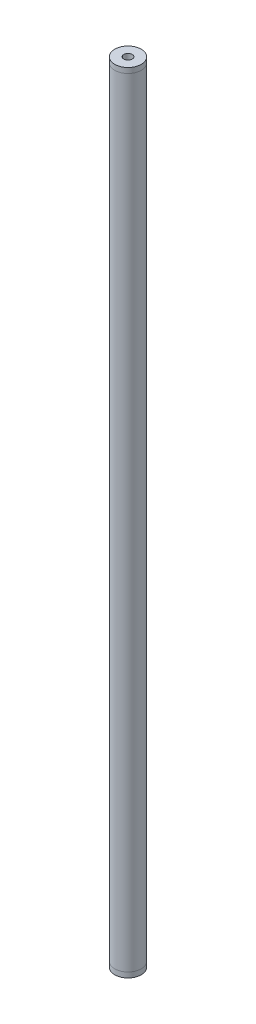
ISO-10303-21;
HEADER;
FILE_DESCRIPTION(('STEP AP214'),'2;1');
FILE_NAME('part.step','',(''),(''),'','','');
FILE_SCHEMA(('AUTOMOTIVE_DESIGN { 1 0 10303 214 1 1 1 1 }'));
ENDSEC;
DATA;
#1=APPLICATION_CONTEXT('core data for automotive mechanical design processes');
#2=APPLICATION_PROTOCOL_DEFINITION('international standard','automotive_design',2000,#1);
#3=PRODUCT_CONTEXT('',#1,'mechanical');
#4=PRODUCT('Part','Part','',(#3));
#5=PRODUCT_RELATED_PRODUCT_CATEGORY('part','',(#4));
#6=PRODUCT_DEFINITION_FORMATION('','',#4);
#7=PRODUCT_DEFINITION_CONTEXT('part definition',#1,'design');
#8=PRODUCT_DEFINITION('design','',#6,#7);
#9=PRODUCT_DEFINITION_SHAPE('','',#8);
#10=(LENGTH_UNIT() NAMED_UNIT(*) SI_UNIT(.MILLI.,.METRE.));
#11=(NAMED_UNIT(*) PLANE_ANGLE_UNIT() SI_UNIT($,.RADIAN.));
#12=(NAMED_UNIT(*) SI_UNIT($,.STERADIAN.) SOLID_ANGLE_UNIT());
#13=UNCERTAINTY_MEASURE_WITH_UNIT(LENGTH_MEASURE(1.E-05),#10,'distance_accuracy_value','');
#14=(GEOMETRIC_REPRESENTATION_CONTEXT(3) GLOBAL_UNCERTAINTY_ASSIGNED_CONTEXT((#13)) GLOBAL_UNIT_ASSIGNED_CONTEXT((#10,
#11,#12)) REPRESENTATION_CONTEXT('',''));
#15=CARTESIAN_POINT('',(0.,0.,0.));
#16=DIRECTION('',(0.,0.,1.));
#17=DIRECTION('',(1.,0.,0.));
#18=AXIS2_PLACEMENT_3D('',#15,#16,#17);
#19=CARTESIAN_POINT('',(25.4,-10.,0.));
#20=DIRECTION('',(0.,-1.,0.));
#21=DIRECTION('',(0.,0.,-1.));
#22=AXIS2_PLACEMENT_3D('',#19,#20,#21);
#23=PLANE('',#22);
#24=CARTESIAN_POINT('',(0.,-10.,0.));
#25=DIRECTION('',(0.,-1.,0.));
#26=DIRECTION('',(0.,0.,-1.));
#27=AXIS2_PLACEMENT_3D('',#24,#25,#26);
#28=CIRCLE('',#27,25.4);
#29=CARTESIAN_POINT('',(0.,-10.,-25.4));
#30=VERTEX_POINT('',#29);
#31=EDGE_CURVE('E64',#30,#30,#28,.T.);
#32=ORIENTED_EDGE('',*,*,#31,.T.);
#33=EDGE_LOOP('',(#32));
#34=FACE_BOUND('',#33,.T.);
#35=CARTESIAN_POINT('',(0.,-10.,0.));
#36=DIRECTION('',(0.,-1.,0.));
#37=DIRECTION('',(0.,0.,-1.));
#38=AXIS2_PLACEMENT_3D('',#35,#36,#37);
#39=CIRCLE('',#38,8.);
#40=CARTESIAN_POINT('',(0.,-10.,-8.));
#41=VERTEX_POINT('',#40);
#42=EDGE_CURVE('E11',#41,#41,#39,.T.);
#43=ORIENTED_EDGE('',*,*,#42,.F.);
#44=EDGE_LOOP('',(#43));
#45=FACE_BOUND('',#44,.T.);
#46=ADVANCED_FACE('F42',(#34,#45),#23,.T.);
#47=CARTESIAN_POINT('',(0.,0.,0.));
#48=DIRECTION('',(0.,-1.,0.));
#49=DIRECTION('',(0.,0.,-1.));
#50=AXIS2_PLACEMENT_3D('',#47,#48,#49);
#51=CYLINDRICAL_SURFACE('',#50,8.);
#52=ORIENTED_EDGE('',*,*,#42,.T.);
#53=EDGE_LOOP('',(#52));
#54=FACE_BOUND('',#53,.T.);
#55=CARTESIAN_POINT('',(0.,40.,0.));
#56=DIRECTION('',(0.,-1.,0.));
#57=DIRECTION('',(0.,0.,-1.));
#58=AXIS2_PLACEMENT_3D('',#55,#56,#57);
#59=CIRCLE('',#58,8.00000000000001);
#60=CARTESIAN_POINT('',(0.,40.,-8.00000000000001));
#61=VERTEX_POINT('',#60);
#62=EDGE_CURVE('E48',#61,#61,#59,.T.);
#63=ORIENTED_EDGE('',*,*,#62,.F.);
#64=EDGE_LOOP('',(#63));
#65=FACE_BOUND('',#64,.T.);
#66=ADVANCED_FACE('F82',(#54,#65),#51,.F.);
#67=CARTESIAN_POINT('',(8.00000000000001,40.,0.));
#68=DIRECTION('',(0.,1.,0.));
#69=DIRECTION('',(0.,0.,1.));
#70=AXIS2_PLACEMENT_3D('',#67,#68,#69);
#71=PLANE('',#70);
#72=ORIENTED_EDGE('',*,*,#62,.T.);
#73=EDGE_LOOP('',(#72));
#74=FACE_BOUND('',#73,.T.);
#75=CARTESIAN_POINT('',(0.,40.,0.));
#76=DIRECTION('',(0.,-1.,0.));
#77=DIRECTION('',(0.,0.,-1.));
#78=AXIS2_PLACEMENT_3D('',#75,#76,#77);
#79=CIRCLE('',#78,21.65);
#80=CARTESIAN_POINT('',(0.,40.,-21.65));
#81=VERTEX_POINT('',#80);
#82=EDGE_CURVE('E52',#81,#81,#79,.T.);
#83=ORIENTED_EDGE('',*,*,#82,.F.);
#84=EDGE_LOOP('',(#83));
#85=FACE_BOUND('',#84,.T.);
#86=ADVANCED_FACE('F86',(#74,#85),#71,.T.);
#87=CARTESIAN_POINT('',(0.,0.,0.));
#88=DIRECTION('',(0.,-1.,0.));
#89=DIRECTION('',(0.,0.,-1.));
#90=AXIS2_PLACEMENT_3D('',#87,#88,#89);
#91=CYLINDRICAL_SURFACE('',#90,21.65);
#92=ORIENTED_EDGE('',*,*,#82,.T.);
#93=EDGE_LOOP('',(#92));
#94=FACE_BOUND('',#93,.T.);
#95=CARTESIAN_POINT('',(0.,0.,0.));
#96=DIRECTION('',(0.,-1.,0.));
#97=DIRECTION('',(0.,0.,-1.));
#98=AXIS2_PLACEMENT_3D('',#95,#96,#97);
#99=CIRCLE('',#98,21.65);
#100=CARTESIAN_POINT('',(0.,0.,-21.65));
#101=VERTEX_POINT('',#100);
#102=EDGE_CURVE('E56',#101,#101,#99,.T.);
#103=ORIENTED_EDGE('',*,*,#102,.F.);
#104=EDGE_LOOP('',(#103));
#105=FACE_BOUND('',#104,.T.);
#106=ADVANCED_FACE('F78',(#94,#105),#91,.T.);
#107=CARTESIAN_POINT('',(21.65,0.,0.));
#108=DIRECTION('',(0.,1.,0.));
#109=DIRECTION('',(0.,0.,1.));
#110=AXIS2_PLACEMENT_3D('',#107,#108,#109);
#111=PLANE('',#110);
#112=ORIENTED_EDGE('',*,*,#102,.T.);
#113=EDGE_LOOP('',(#112));
#114=FACE_BOUND('',#113,.T.);
#115=CARTESIAN_POINT('',(0.,0.,0.));
#116=DIRECTION('',(0.,-1.,0.));
#117=DIRECTION('',(0.,0.,-1.));
#118=AXIS2_PLACEMENT_3D('',#115,#116,#117);
#119=CIRCLE('',#118,25.4);
#120=CARTESIAN_POINT('',(0.,0.,-25.4));
#121=VERTEX_POINT('',#120);
#122=EDGE_CURVE('E61',#121,#121,#119,.T.);
#123=ORIENTED_EDGE('',*,*,#122,.F.);
#124=EDGE_LOOP('',(#123));
#125=FACE_BOUND('',#124,.T.);
#126=ADVANCED_FACE('F72',(#114,#125),#111,.T.);
#127=CARTESIAN_POINT('',(0.,0.,0.));
#128=DIRECTION('',(0.,-1.,0.));
#129=DIRECTION('',(0.,0.,-1.));
#130=AXIS2_PLACEMENT_3D('',#127,#128,#129);
#131=CYLINDRICAL_SURFACE('',#130,25.4);
#132=ORIENTED_EDGE('',*,*,#122,.T.);
#133=EDGE_LOOP('',(#132));
#134=FACE_BOUND('',#133,.T.);
#135=ORIENTED_EDGE('',*,*,#31,.F.);
#136=EDGE_LOOP('',(#135));
#137=FACE_BOUND('',#136,.T.);
#138=ADVANCED_FACE('F70',(#134,#137),#131,.T.);
#139=CLOSED_SHELL('',(#46,#66,#86,#106,#126,#138));
#140=MANIFOLD_SOLID_BREP('B2',#139);
#141=CARTESIAN_POINT('',(21.65,1500.,0.));
#142=DIRECTION('',(0.,-1.,0.));
#143=DIRECTION('',(0.,0.,-1.));
#144=AXIS2_PLACEMENT_3D('',#141,#142,#143);
#145=PLANE('',#144);
#146=CARTESIAN_POINT('',(0.,1500.,0.));
#147=DIRECTION('',(0.,-1.,0.));
#148=DIRECTION('',(0.,0.,-1.));
#149=AXIS2_PLACEMENT_3D('',#146,#147,#148);
#150=CIRCLE('',#149,25.4);
#151=CARTESIAN_POINT('',(0.,1500.,-25.4));
#152=VERTEX_POINT('',#151);
#153=EDGE_CURVE('E41',#152,#152,#150,.T.);
#154=ORIENTED_EDGE('',*,*,#153,.T.);
#155=EDGE_LOOP('',(#154));
#156=FACE_BOUND('',#155,.T.);
#157=CARTESIAN_POINT('',(0.,1500.,0.));
#158=DIRECTION('',(0.,-1.,0.));
#159=DIRECTION('',(0.,0.,-1.));
#160=AXIS2_PLACEMENT_3D('',#157,#158,#159);
#161=CIRCLE('',#160,21.65);
#162=CARTESIAN_POINT('',(0.,1500.,-21.65));
#163=VERTEX_POINT('',#162);
#164=EDGE_CURVE('E163',#163,#163,#161,.T.);
#165=ORIENTED_EDGE('',*,*,#164,.F.);
#166=EDGE_LOOP('',(#165));
#167=FACE_BOUND('',#166,.T.);
#168=ADVANCED_FACE('F141',(#156,#167),#145,.T.);
#169=CARTESIAN_POINT('',(0.,0.,0.));
#170=DIRECTION('',(0.,-1.,0.));
#171=DIRECTION('',(0.,0.,-1.));
#172=AXIS2_PLACEMENT_3D('',#169,#170,#171);
#173=CYLINDRICAL_SURFACE('',#172,25.4);
#174=CARTESIAN_POINT('',(0.,1510.,0.));
#175=DIRECTION('',(0.,-1.,0.));
#176=DIRECTION('',(0.,0.,-1.));
#177=AXIS2_PLACEMENT_3D('',#174,#175,#176);
#178=CIRCLE('',#177,25.4);
#179=CARTESIAN_POINT('',(0.,1510.,-25.4));
#180=VERTEX_POINT('',#179);
#181=EDGE_CURVE('E147',#180,#180,#178,.T.);
#182=ORIENTED_EDGE('',*,*,#181,.T.);
#183=EDGE_LOOP('',(#182));
#184=FACE_BOUND('',#183,.T.);
#185=ORIENTED_EDGE('',*,*,#153,.F.);
#186=EDGE_LOOP('',(#185));
#187=FACE_BOUND('',#186,.T.);
#188=ADVANCED_FACE('F171',(#184,#187),#173,.T.);
#189=CARTESIAN_POINT('',(25.4,1510.,0.));
#190=DIRECTION('',(0.,1.,0.));
#191=DIRECTION('',(0.,0.,1.));
#192=AXIS2_PLACEMENT_3D('',#189,#190,#191);
#193=PLANE('',#192);
#194=CARTESIAN_POINT('',(0.,1510.,0.));
#195=DIRECTION('',(0.,-1.,0.));
#196=DIRECTION('',(0.,0.,-1.));
#197=AXIS2_PLACEMENT_3D('',#194,#195,#196);
#198=CIRCLE('',#197,7.99999999999996);
#199=CARTESIAN_POINT('',(0.,1510.,-7.99999999999996));
#200=VERTEX_POINT('',#199);
#201=EDGE_CURVE('E151',#200,#200,#198,.T.);
#202=ORIENTED_EDGE('',*,*,#201,.T.);
#203=EDGE_LOOP('',(#202));
#204=FACE_BOUND('',#203,.T.);
#205=ORIENTED_EDGE('',*,*,#181,.F.);
#206=EDGE_LOOP('',(#205));
#207=FACE_BOUND('',#206,.T.);
#208=ADVANCED_FACE('F175',(#204,#207),#193,.T.);
#209=CARTESIAN_POINT('',(0.,0.,0.));
#210=DIRECTION('',(0.,-1.,0.));
#211=DIRECTION('',(0.,0.,-1.));
#212=AXIS2_PLACEMENT_3D('',#209,#210,#211);
#213=CYLINDRICAL_SURFACE('',#212,7.99999999999997);
#214=CARTESIAN_POINT('',(0.,1460.,0.));
#215=DIRECTION('',(0.,-1.,0.));
#216=DIRECTION('',(0.,0.,-1.));
#217=AXIS2_PLACEMENT_3D('',#214,#215,#216);
#218=CIRCLE('',#217,7.99999999999997);
#219=CARTESIAN_POINT('',(0.,1460.,-7.99999999999997));
#220=VERTEX_POINT('',#219);
#221=EDGE_CURVE('E155',#220,#220,#218,.T.);
#222=ORIENTED_EDGE('',*,*,#221,.T.);
#223=EDGE_LOOP('',(#222));
#224=FACE_BOUND('',#223,.T.);
#225=ORIENTED_EDGE('',*,*,#201,.F.);
#226=EDGE_LOOP('',(#225));
#227=FACE_BOUND('',#226,.T.);
#228=ADVANCED_FACE('F179',(#224,#227),#213,.F.);
#229=CARTESIAN_POINT('',(7.99999999999997,1460.,0.));
#230=DIRECTION('',(0.,-1.,0.));
#231=DIRECTION('',(0.,0.,-1.));
#232=AXIS2_PLACEMENT_3D('',#229,#230,#231);
#233=PLANE('',#232);
#234=CARTESIAN_POINT('',(0.,1460.,0.));
#235=DIRECTION('',(0.,-1.,0.));
#236=DIRECTION('',(0.,0.,-1.));
#237=AXIS2_PLACEMENT_3D('',#234,#235,#236);
#238=CIRCLE('',#237,21.65);
#239=CARTESIAN_POINT('',(0.,1460.,-21.65));
#240=VERTEX_POINT('',#239);
#241=EDGE_CURVE('E160',#240,#240,#238,.T.);
#242=ORIENTED_EDGE('',*,*,#241,.T.);
#243=EDGE_LOOP('',(#242));
#244=FACE_BOUND('',#243,.T.);
#245=ORIENTED_EDGE('',*,*,#221,.F.);
#246=EDGE_LOOP('',(#245));
#247=FACE_BOUND('',#246,.T.);
#248=ADVANCED_FACE('F186',(#244,#247),#233,.T.);
#249=CARTESIAN_POINT('',(0.,0.,0.));
#250=DIRECTION('',(0.,-1.,0.));
#251=DIRECTION('',(0.,0.,-1.));
#252=AXIS2_PLACEMENT_3D('',#249,#250,#251);
#253=CYLINDRICAL_SURFACE('',#252,21.65);
#254=ORIENTED_EDGE('',*,*,#164,.T.);
#255=EDGE_LOOP('',(#254));
#256=FACE_BOUND('',#255,.T.);
#257=ORIENTED_EDGE('',*,*,#241,.F.);
#258=EDGE_LOOP('',(#257));
#259=FACE_BOUND('',#258,.T.);
#260=ADVANCED_FACE('F167',(#256,#259),#253,.T.);
#261=CLOSED_SHELL('',(#168,#188,#208,#228,#248,#260));
#262=MANIFOLD_SOLID_BREP('B6',#261);
#263=CARTESIAN_POINT('',(0.,1500.,0.));
#264=DIRECTION('',(0.,1.,0.));
#265=DIRECTION('',(0.,0.,1.));
#266=AXIS2_PLACEMENT_3D('',#263,#264,#265);
#267=PLANE('',#266);
#268=CARTESIAN_POINT('',(0.,1500.,0.));
#269=DIRECTION('',(0.,1.,0.));
#270=DIRECTION('',(0.,0.,1.));
#271=AXIS2_PLACEMENT_3D('',#268,#269,#270);
#272=CIRCLE('',#271,25.4);
#273=CARTESIAN_POINT('',(0.,1500.,25.4));
#274=VERTEX_POINT('',#273);
#275=EDGE_CURVE('E140',#274,#274,#272,.T.);
#276=ORIENTED_EDGE('',*,*,#275,.T.);
#277=EDGE_LOOP('',(#276));
#278=FACE_BOUND('',#277,.T.);
#279=CARTESIAN_POINT('',(0.,1500.,0.));
#280=DIRECTION('',(0.,1.,0.));
#281=DIRECTION('',(0.,0.,1.));
#282=AXIS2_PLACEMENT_3D('',#279,#280,#281);
#283=CIRCLE('',#282,21.65);
#284=CARTESIAN_POINT('',(0.,1500.,21.65));
#285=VERTEX_POINT('',#284);
#286=EDGE_CURVE('E244',#285,#285,#283,.T.);
#287=ORIENTED_EDGE('',*,*,#286,.F.);
#288=EDGE_LOOP('',(#287));
#289=FACE_BOUND('',#288,.T.);
#290=ADVANCED_FACE('F233',(#278,#289),#267,.T.);
#291=CARTESIAN_POINT('',(0.,0.,0.));
#292=DIRECTION('',(0.,1.,0.));
#293=DIRECTION('',(0.,0.,1.));
#294=AXIS2_PLACEMENT_3D('',#291,#292,#293);
#295=PLANE('',#294);
#296=CARTESIAN_POINT('',(0.,0.,0.));
#297=DIRECTION('',(0.,1.,0.));
#298=DIRECTION('',(0.,0.,1.));
#299=AXIS2_PLACEMENT_3D('',#296,#297,#298);
#300=CIRCLE('',#299,25.4);
#301=CARTESIAN_POINT('',(0.,0.,25.4));
#302=VERTEX_POINT('',#301);
#303=EDGE_CURVE('E237',#302,#302,#300,.T.);
#304=ORIENTED_EDGE('',*,*,#303,.F.);
#305=EDGE_LOOP('',(#304));
#306=FACE_BOUND('',#305,.T.);
#307=CARTESIAN_POINT('',(0.,0.,0.));
#308=DIRECTION('',(0.,1.,0.));
#309=DIRECTION('',(0.,0.,1.));
#310=AXIS2_PLACEMENT_3D('',#307,#308,#309);
#311=CIRCLE('',#310,21.65);
#312=CARTESIAN_POINT('',(0.,0.,21.65));
#313=VERTEX_POINT('',#312);
#314=EDGE_CURVE('E246',#313,#313,#311,.T.);
#315=ORIENTED_EDGE('',*,*,#314,.T.);
#316=EDGE_LOOP('',(#315));
#317=FACE_BOUND('',#316,.T.);
#318=ADVANCED_FACE('F256',(#306,#317),#295,.F.);
#319=CARTESIAN_POINT('',(0.,1500.,0.));
#320=DIRECTION('',(0.,-1.,0.));
#321=DIRECTION('',(0.,0.,-1.));
#322=AXIS2_PLACEMENT_3D('',#319,#320,#321);
#323=CYLINDRICAL_SURFACE('',#322,25.4);
#324=ORIENTED_EDGE('',*,*,#275,.F.);
#325=EDGE_LOOP('',(#324));
#326=FACE_BOUND('',#325,.T.);
#327=ORIENTED_EDGE('',*,*,#303,.T.);
#328=EDGE_LOOP('',(#327));
#329=FACE_BOUND('',#328,.T.);
#330=ADVANCED_FACE('F235',(#326,#329),#323,.T.);
#331=CARTESIAN_POINT('',(0.,1500.,0.));
#332=DIRECTION('',(0.,-1.,0.));
#333=DIRECTION('',(0.,0.,-1.));
#334=AXIS2_PLACEMENT_3D('',#331,#332,#333);
#335=CYLINDRICAL_SURFACE('',#334,21.65);
#336=ORIENTED_EDGE('',*,*,#286,.T.);
#337=EDGE_LOOP('',(#336));
#338=FACE_BOUND('',#337,.T.);
#339=ORIENTED_EDGE('',*,*,#314,.F.);
#340=EDGE_LOOP('',(#339));
#341=FACE_BOUND('',#340,.T.);
#342=ADVANCED_FACE('F252',(#338,#341),#335,.F.);
#343=CLOSED_SHELL('',(#290,#318,#330,#342));
#344=MANIFOLD_SOLID_BREP('B36',#343);
#345=ADVANCED_BREP_SHAPE_REPRESENTATION('',(#18,#140,#262,#344),#14);
#346=SHAPE_DEFINITION_REPRESENTATION(#9,#345);
ENDSEC;
END-ISO-10303-21;
